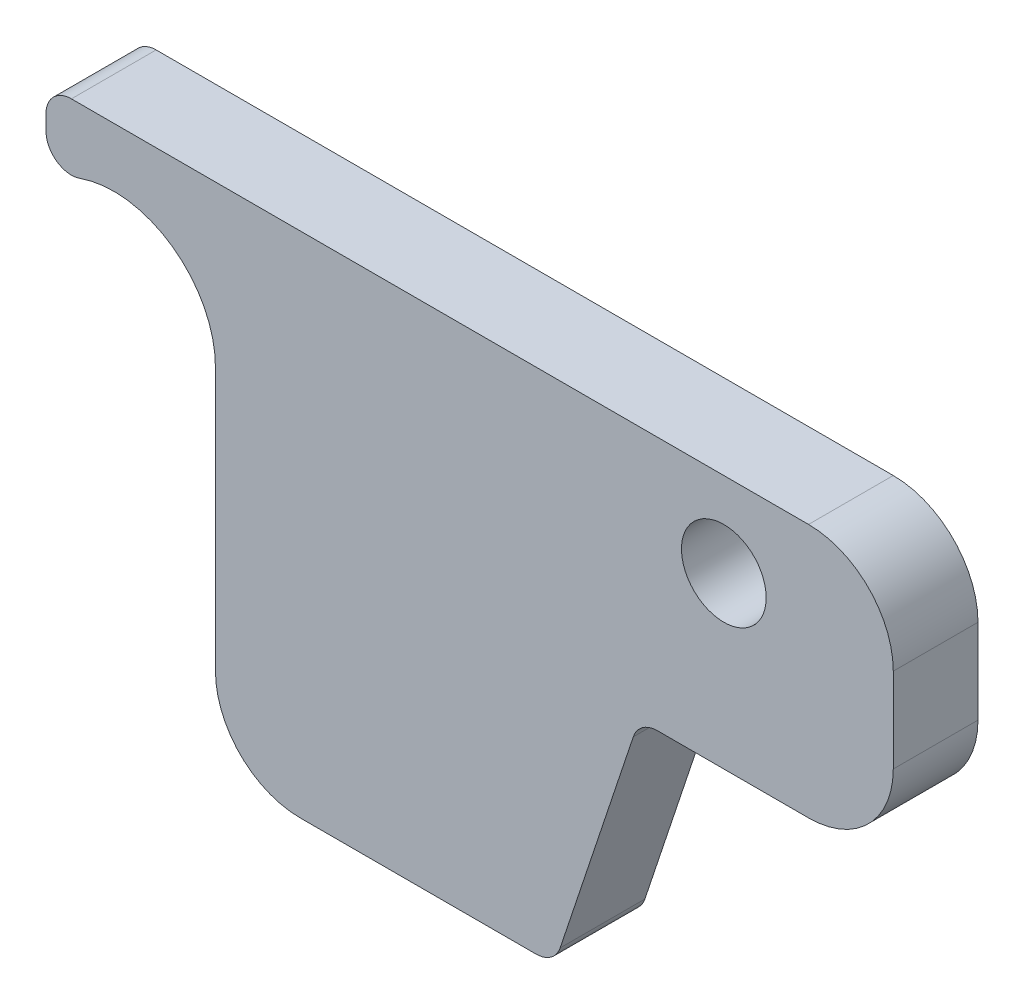
ISO-10303-21;
HEADER;
FILE_DESCRIPTION(('STEP AP214'),'2;1');
FILE_NAME('part.step','',(''),(''),'','','');
FILE_SCHEMA(('AUTOMOTIVE_DESIGN { 1 0 10303 214 1 1 1 1 }'));
ENDSEC;
DATA;
#1=APPLICATION_CONTEXT('core data for automotive mechanical design processes');
#2=APPLICATION_PROTOCOL_DEFINITION('international standard','automotive_design',2000,#1);
#3=PRODUCT_CONTEXT('',#1,'mechanical');
#4=PRODUCT('Part','Part','',(#3));
#5=PRODUCT_RELATED_PRODUCT_CATEGORY('part','',(#4));
#6=PRODUCT_DEFINITION_FORMATION('','',#4);
#7=PRODUCT_DEFINITION_CONTEXT('part definition',#1,'design');
#8=PRODUCT_DEFINITION('design','',#6,#7);
#9=PRODUCT_DEFINITION_SHAPE('','',#8);
#10=(LENGTH_UNIT() NAMED_UNIT(*) SI_UNIT(.MILLI.,.METRE.));
#11=(NAMED_UNIT(*) PLANE_ANGLE_UNIT() SI_UNIT($,.RADIAN.));
#12=(NAMED_UNIT(*) SI_UNIT($,.STERADIAN.) SOLID_ANGLE_UNIT());
#13=UNCERTAINTY_MEASURE_WITH_UNIT(LENGTH_MEASURE(1.E-05),#10,'distance_accuracy_value','');
#14=(GEOMETRIC_REPRESENTATION_CONTEXT(3) GLOBAL_UNCERTAINTY_ASSIGNED_CONTEXT((#13)) GLOBAL_UNIT_ASSIGNED_CONTEXT((#10,
#11,#12)) REPRESENTATION_CONTEXT('',''));
#15=CARTESIAN_POINT('',(0.,0.,0.));
#16=DIRECTION('',(0.,0.,1.));
#17=DIRECTION('',(1.,0.,0.));
#18=AXIS2_PLACEMENT_3D('',#15,#16,#17);
#19=CARTESIAN_POINT('',(50.0000000000022,30.0000000000006,10.0000000000017));
#20=DIRECTION('',(-1.00000000000003,0.,0.));
#21=DIRECTION('',(0.,-1.00000000000001,0.));
#22=AXIS2_PLACEMENT_3D('',#19,#20,#21);
#23=PLANE('',#22);
#24=DIRECTION('',(0.,1.00000000000001,0.));
#25=VECTOR('',#24,1.);
#26=CARTESIAN_POINT('',(50.0000000000008,30.,0.));
#27=LINE('',#26,#25);
#28=CARTESIAN_POINT('',(50.0000000000003,10.0000000000009,8.32667268468867E-13));
#29=VERTEX_POINT('',#28);
#30=CARTESIAN_POINT('',(49.9999999999994,20.0000000000015,9.99200722162641E-13));
#31=VERTEX_POINT('',#30);
#32=EDGE_CURVE('E183',#29,#31,#27,.T.);
#33=ORIENTED_EDGE('',*,*,#32,.T.);
#34=DIRECTION('',(0.,0.,-1.));
#35=VECTOR('',#34,1.);
#36=CARTESIAN_POINT('',(49.9999999999985,20.0000000000017,10.0000000000009));
#37=LINE('',#36,#35);
#38=CARTESIAN_POINT('',(49.9999999999985,20.0000000000017,10.0000000000009));
#39=VERTEX_POINT('',#38);
#40=EDGE_CURVE('E286',#31,#39,#37,.F.);
#41=ORIENTED_EDGE('',*,*,#40,.T.);
#42=DIRECTION('',(0.,1.00000000000001,0.));
#43=VECTOR('',#42,1.);
#44=CARTESIAN_POINT('',(50.0000000000022,30.0000000000006,10.0000000000017));
#45=LINE('',#44,#43);
#46=CARTESIAN_POINT('',(50.0000000000007,9.99999999999978,10.0000000000002));
#47=VERTEX_POINT('',#46);
#48=EDGE_CURVE('E189',#47,#39,#45,.T.);
#49=ORIENTED_EDGE('',*,*,#48,.F.);
#50=DIRECTION('',(0.,0.,1.));
#51=VECTOR('',#50,1.);
#52=CARTESIAN_POINT('',(50.0000000000007,9.99999999999978,10.0000000000002));
#53=LINE('',#52,#51);
#54=EDGE_CURVE('E283',#47,#29,#53,.F.);
#55=ORIENTED_EDGE('',*,*,#54,.T.);
#56=EDGE_LOOP('',(#33,#41,#49,#55));
#57=FACE_BOUND('',#56,.T.);
#58=ADVANCED_FACE('F38',(#57),#23,.F.);
#59=CARTESIAN_POINT('',(-50.0000000000025,29.9999999999994,10.0000000000003));
#60=DIRECTION('',(0.,-1.00000000000001,0.));
#61=DIRECTION('',(0.,0.,-1.));
#62=AXIS2_PLACEMENT_3D('',#59,#60,#61);
#63=PLANE('',#62);
#64=DIRECTION('',(-1.00000000000003,0.,0.));
#65=VECTOR('',#64,1.);
#66=CARTESIAN_POINT('',(-50.0000000000025,29.9999999999994,10.0000000000003));
#67=LINE('',#66,#65);
#68=CARTESIAN_POINT('',(40.0000000000025,30.0000000000009,10.0000000000011));
#69=VERTEX_POINT('',#68);
#70=CARTESIAN_POINT('',(-47.0000000000015,29.9999999999996,9.9999999999999));
#71=VERTEX_POINT('',#70);
#72=EDGE_CURVE('E192',#69,#71,#67,.T.);
#73=ORIENTED_EDGE('',*,*,#72,.F.);
#74=DIRECTION('',(0.,0.,-1.));
#75=VECTOR('',#74,1.);
#76=CARTESIAN_POINT('',(40.0000000000025,30.0000000000009,10.0000000000011));
#77=LINE('',#76,#75);
#78=CARTESIAN_POINT('',(40.0000000000008,30.0000000000009,1.84574577843932E-12));
#79=VERTEX_POINT('',#78);
#80=EDGE_CURVE('E270',#69,#79,#77,.T.);
#81=ORIENTED_EDGE('',*,*,#80,.T.);
#82=DIRECTION('',(-1.00000000000003,0.,0.));
#83=VECTOR('',#82,1.);
#84=CARTESIAN_POINT('',(-50.0000000000006,30.0000000000005,1.01307850997046E-12));
#85=LINE('',#84,#83);
#86=CARTESIAN_POINT('',(-46.9999999999999,29.9999999999995,0.));
#87=VERTEX_POINT('',#86);
#88=EDGE_CURVE('E206',#79,#87,#85,.T.);
#89=ORIENTED_EDGE('',*,*,#88,.T.);
#90=DIRECTION('',(0.,0.,-1.));
#91=VECTOR('',#90,1.);
#92=CARTESIAN_POINT('',(-47.0000000000015,29.9999999999996,9.9999999999999));
#93=LINE('',#92,#91);
#94=EDGE_CURVE('E256',#87,#71,#93,.F.);
#95=ORIENTED_EDGE('',*,*,#94,.T.);
#96=EDGE_LOOP('',(#73,#81,#89,#95));
#97=FACE_BOUND('',#96,.T.);
#98=ADVANCED_FACE('F340',(#97),#63,.F.);
#99=CARTESIAN_POINT('',(-50.0000000000025,29.9999999999994,10.0000000000003));
#100=DIRECTION('',(1.00000000000003,0.,0.));
#101=DIRECTION('',(0.,1.00000000000001,0.));
#102=AXIS2_PLACEMENT_3D('',#99,#100,#101);
#103=PLANE('',#102);
#104=DIRECTION('',(0.,-1.00000000000001,0.));
#105=VECTOR('',#104,1.);
#106=CARTESIAN_POINT('',(-50.0000000000025,29.9999999999994,10.0000000000003));
#107=LINE('',#106,#105);
#108=CARTESIAN_POINT('',(-50.0000000000038,26.9999999999987,10.0000000000007));
#109=VERTEX_POINT('',#108);
#110=CARTESIAN_POINT('',(-50.0000000000013,25.1978637137314,10.0000000000006));
#111=VERTEX_POINT('',#110);
#112=EDGE_CURVE('E196',#109,#111,#107,.T.);
#113=ORIENTED_EDGE('',*,*,#112,.F.);
#114=DIRECTION('',(0.,0.,-1.));
#115=VECTOR('',#114,1.);
#116=CARTESIAN_POINT('',(-50.0000000000038,26.9999999999987,10.0000000000007));
#117=LINE('',#116,#115);
#118=CARTESIAN_POINT('',(-50.0000000000032,27.000000000001,-4.02455846426619E-13));
#119=VERTEX_POINT('',#118);
#120=EDGE_CURVE('E252',#109,#119,#117,.T.);
#121=ORIENTED_EDGE('',*,*,#120,.T.);
#122=DIRECTION('',(0.,-1.00000000000001,0.));
#123=VECTOR('',#122,1.);
#124=CARTESIAN_POINT('',(-50.0000000000006,30.0000000000005,1.01307850997046E-12));
#125=LINE('',#124,#123);
#126=CARTESIAN_POINT('',(-49.9999999999971,25.197863713732,1.87350135405495E-12));
#127=VERTEX_POINT('',#126);
#128=EDGE_CURVE('E209',#119,#127,#125,.T.);
#129=ORIENTED_EDGE('',*,*,#128,.T.);
#130=DIRECTION('',(0.,0.,1.));
#131=VECTOR('',#130,1.);
#132=CARTESIAN_POINT('',(-50.0000000000013,25.1978637137314,10.0000000000006));
#133=LINE('',#132,#131);
#134=EDGE_CURVE('E248',#127,#111,#133,.T.);
#135=ORIENTED_EDGE('',*,*,#134,.T.);
#136=EDGE_LOOP('',(#113,#121,#129,#135));
#137=FACE_BOUND('',#136,.T.);
#138=ADVANCED_FACE('F331',(#137),#103,.F.);
#139=CARTESIAN_POINT('',(-50.000000000001,-30.0000000000009,9.99999999999966));
#140=DIRECTION('',(0.,1.00000000000001,0.));
#141=DIRECTION('',(0.,0.,1.));
#142=AXIS2_PLACEMENT_3D('',#139,#140,#141);
#143=PLANE('',#142);
#144=DIRECTION('',(1.00000000000003,0.,0.));
#145=VECTOR('',#144,1.);
#146=CARTESIAN_POINT('',(-50.000000000001,-30.0000000000009,9.99999999999966));
#147=LINE('',#146,#145);
#148=CARTESIAN_POINT('',(-20.0000000000007,-30.0000000000002,10.0000000000003));
#149=VERTEX_POINT('',#148);
#150=CARTESIAN_POINT('',(7.83772233983152,-30.0000000000001,10.0000000000014));
#151=VERTEX_POINT('',#150);
#152=EDGE_CURVE('E199',#149,#151,#147,.T.);
#153=ORIENTED_EDGE('',*,*,#152,.F.);
#154=DIRECTION('',(0.,0.,1.));
#155=VECTOR('',#154,1.);
#156=CARTESIAN_POINT('',(-20.0000000000007,-30.0000000000002,10.0000000000003));
#157=LINE('',#156,#155);
#158=CARTESIAN_POINT('',(-19.9999999999994,-30.0000000000006,8.46545056276682E-13));
#159=VERTEX_POINT('',#158);
#160=EDGE_CURVE('E11',#149,#159,#157,.F.);
#161=ORIENTED_EDGE('',*,*,#160,.T.);
#162=DIRECTION('',(1.00000000000003,0.,0.));
#163=VECTOR('',#162,1.);
#164=CARTESIAN_POINT('',(-50.0000000000002,-30.0000000000001,1.11022302462516E-13));
#165=LINE('',#164,#163);
#166=CARTESIAN_POINT('',(7.8377223398324,-29.9999999999999,1.346145417358E-12));
#167=VERTEX_POINT('',#166);
#168=EDGE_CURVE('E193',#159,#167,#165,.T.);
#169=ORIENTED_EDGE('',*,*,#168,.T.);
#170=DIRECTION('',(0.,0.,1.));
#171=VECTOR('',#170,1.);
#172=CARTESIAN_POINT('',(7.83772233983152,-30.0000000000001,10.0000000000014));
#173=LINE('',#172,#171);
#174=EDGE_CURVE('E225',#167,#151,#173,.T.);
#175=ORIENTED_EDGE('',*,*,#174,.T.);
#176=EDGE_LOOP('',(#153,#161,#169,#175));
#177=FACE_BOUND('',#176,.T.);
#178=ADVANCED_FACE('F384',(#177),#143,.F.);
#179=CARTESIAN_POINT('',(-1.38777878078145E-13,9.22872889219661E-13,10.0000000000008));
#180=DIRECTION('',(0.,0.,1.));
#181=DIRECTION('',(1.00000000000003,0.,0.));
#182=AXIS2_PLACEMENT_3D('',#179,#180,#181);
#183=PLANE('',#182);
#184=ORIENTED_EDGE('',*,*,#48,.T.);
#185=CARTESIAN_POINT('',(39.9999999999985,20.0000000000001,10.0000000000008));
#186=DIRECTION('',(0.,0.,1.));
#187=DIRECTION('',(1.00000000000003,0.,0.));
#188=AXIS2_PLACEMENT_3D('',#185,#186,#187);
#189=CIRCLE('',#188,10.);
#190=EDGE_CURVE('E293',#39,#69,#189,.T.);
#191=ORIENTED_EDGE('',*,*,#190,.T.);
#192=ORIENTED_EDGE('',*,*,#72,.T.);
#193=CARTESIAN_POINT('',(-47.0000000000016,26.9999999999997,10.0000000000009));
#194=DIRECTION('',(0.,0.,1.));
#195=DIRECTION('',(1.00000000000003,0.,0.));
#196=AXIS2_PLACEMENT_3D('',#193,#194,#195);
#197=CIRCLE('',#196,3.);
#198=EDGE_CURVE('E231',#71,#109,#197,.T.);
#199=ORIENTED_EDGE('',*,*,#198,.T.);
#200=ORIENTED_EDGE('',*,*,#112,.T.);
#201=CARTESIAN_POINT('',(-47.0000000000008,25.1978637137329,10.0000000000012));
#202=DIRECTION('',(0.,0.,1.));
#203=DIRECTION('',(1.00000000000003,0.,0.));
#204=AXIS2_PLACEMENT_3D('',#201,#202,#203);
#205=CIRCLE('',#204,3.);
#206=CARTESIAN_POINT('',(-46.0000000000013,22.3694365889861,10.000000000001));
#207=VERTEX_POINT('',#206);
#208=EDGE_CURVE('E172',#111,#207,#205,.T.);
#209=ORIENTED_EDGE('',*,*,#208,.T.);
#210=CARTESIAN_POINT('',(-42.0000000000025,11.0557280899991,10.0000000000006));
#211=DIRECTION('',(0.,0.,1.));
#212=DIRECTION('',(1.00000000000003,0.,0.));
#213=AXIS2_PLACEMENT_3D('',#210,#211,#212);
#214=CIRCLE('',#213,12.);
#215=CARTESIAN_POINT('',(-29.9999999999996,11.0557280900008,10.0000000000014));
#216=VERTEX_POINT('',#215);
#217=EDGE_CURVE('E156',#216,#207,#214,.T.);
#218=ORIENTED_EDGE('',*,*,#217,.F.);
#219=DIRECTION('',(0.,1.00000000000001,0.));
#220=VECTOR('',#219,1.);
#221=CARTESIAN_POINT('',(-29.9999999999996,11.0557280900008,10.0000000000014));
#222=LINE('',#221,#220);
#223=CARTESIAN_POINT('',(-30.0000000000013,-20.0000000000007,10.0000000000005));
#224=VERTEX_POINT('',#223);
#225=EDGE_CURVE('E147',#224,#216,#222,.T.);
#226=ORIENTED_EDGE('',*,*,#225,.F.);
#227=CARTESIAN_POINT('',(-19.9999999999997,-20.0000000000009,9.99999999999902));
#228=DIRECTION('',(0.,0.,1.));
#229=DIRECTION('',(1.00000000000003,0.,0.));
#230=AXIS2_PLACEMENT_3D('',#227,#228,#229);
#231=CIRCLE('',#230,10.);
#232=EDGE_CURVE('E54',#224,#149,#231,.T.);
#233=ORIENTED_EDGE('',*,*,#232,.T.);
#234=ORIENTED_EDGE('',*,*,#152,.T.);
#235=CARTESIAN_POINT('',(7.8377223398321,-27.0000000000008,10.0000000000001));
#236=DIRECTION('',(0.,0.,1.));
#237=DIRECTION('',(1.00000000000003,0.,0.));
#238=AXIS2_PLACEMENT_3D('',#235,#236,#237);
#239=CIRCLE('',#238,3.);
#240=CARTESIAN_POINT('',(10.6837722339818,-27.9486832980503,10.0000000000002));
#241=VERTEX_POINT('',#240);
#242=EDGE_CURVE('E234',#151,#241,#239,.T.);
#243=ORIENTED_EDGE('',*,*,#242,.T.);
#244=DIRECTION('',(-0.316227766016851,-0.948683298050519,0.));
#245=VECTOR('',#244,1.);
#246=CARTESIAN_POINT('',(20.0000000000003,5.82867087928207E-13,10.000000000001));
#247=LINE('',#246,#245);
#248=CARTESIAN_POINT('',(19.3162277660149,-2.05131670194864,10.0000000000006));
#249=VERTEX_POINT('',#248);
#250=EDGE_CURVE('E309',#249,#241,#247,.T.);
#251=ORIENTED_EDGE('',*,*,#250,.F.);
#252=CARTESIAN_POINT('',(22.1622776601672,-3.00000000000023,10.0000000000005));
#253=DIRECTION('',(0.,0.,1.));
#254=DIRECTION('',(1.00000000000003,0.,0.));
#255=AXIS2_PLACEMENT_3D('',#252,#253,#254);
#256=CIRCLE('',#255,3.);
#257=CARTESIAN_POINT('',(22.1622776601686,1.58206781009085E-12,10.0000000000003));
#258=VERTEX_POINT('',#257);
#259=EDGE_CURVE('E263',#249,#258,#256,.F.);
#260=ORIENTED_EDGE('',*,*,#259,.T.);
#261=DIRECTION('',(-1.00000000000003,0.,0.));
#262=VECTOR('',#261,1.);
#263=CARTESIAN_POINT('',(50.0000000000017,1.13103970633688E-12,10.0000000000018));
#264=LINE('',#263,#262);
#265=CARTESIAN_POINT('',(40.0000000000004,1.09634523681734E-12,10.0000000000006));
#266=VERTEX_POINT('',#265);
#267=EDGE_CURVE('E165',#266,#258,#264,.T.);
#268=ORIENTED_EDGE('',*,*,#267,.F.);
#269=CARTESIAN_POINT('',(40.,10.0000000000012,10.0000000000009));
#270=DIRECTION('',(0.,0.,1.));
#271=DIRECTION('',(1.00000000000003,0.,0.));
#272=AXIS2_PLACEMENT_3D('',#269,#270,#271);
#273=CIRCLE('',#272,10.);
#274=EDGE_CURVE('E62',#266,#47,#273,.T.);
#275=ORIENTED_EDGE('',*,*,#274,.T.);
#276=EDGE_LOOP('',(#184,#191,#192,#199,#200,#209,#218,#226,#233,#234,#243,#251,#260,#268,#275));
#277=FACE_BOUND('',#276,.T.);
#278=CARTESIAN_POINT('',(29.9999999999977,20.0000000000011,10.0000000000002));
#279=DIRECTION('',(0.,0.,1.));
#280=DIRECTION('',(1.00000000000003,0.,0.));
#281=AXIS2_PLACEMENT_3D('',#278,#279,#280);
#282=CIRCLE('',#281,5.);
#283=CARTESIAN_POINT('',(34.9999999999979,20.0000000000012,10.0000000000002));
#284=VERTEX_POINT('',#283);
#285=EDGE_CURVE('E184',#284,#284,#282,.T.);
#286=ORIENTED_EDGE('',*,*,#285,.F.);
#287=EDGE_LOOP('',(#286));
#288=FACE_BOUND('',#287,.T.);
#289=ADVANCED_FACE('F169',(#277,#288),#183,.T.);
#290=CARTESIAN_POINT('',(0.,0.,0.));
#291=DIRECTION('',(0.,0.,1.));
#292=DIRECTION('',(1.00000000000003,0.,0.));
#293=AXIS2_PLACEMENT_3D('',#290,#291,#292);
#294=PLANE('',#293);
#295=CARTESIAN_POINT('',(29.9999999999984,20.0000000000004,1.38777878078145E-13));
#296=DIRECTION('',(0.,0.,1.));
#297=DIRECTION('',(1.00000000000003,0.,0.));
#298=AXIS2_PLACEMENT_3D('',#295,#296,#297);
#299=CIRCLE('',#298,5.);
#300=CARTESIAN_POINT('',(34.9999999999986,20.0000000000004,1.31338602299795E-13));
#301=VERTEX_POINT('',#300);
#302=EDGE_CURVE('E180',#301,#301,#299,.T.);
#303=ORIENTED_EDGE('',*,*,#302,.T.);
#304=EDGE_LOOP('',(#303));
#305=FACE_BOUND('',#304,.T.);
#306=ORIENTED_EDGE('',*,*,#88,.F.);
#307=CARTESIAN_POINT('',(39.9999999999995,19.9999999999998,1.52655665885959E-13));
#308=DIRECTION('',(0.,0.,1.));
#309=DIRECTION('',(1.00000000000003,0.,0.));
#310=AXIS2_PLACEMENT_3D('',#307,#308,#309);
#311=CIRCLE('',#310,10.);
#312=EDGE_CURVE('E280',#79,#31,#311,.F.);
#313=ORIENTED_EDGE('',*,*,#312,.T.);
#314=ORIENTED_EDGE('',*,*,#32,.F.);
#315=CARTESIAN_POINT('',(40.,10.0000000000006,5.27355936696949E-13));
#316=DIRECTION('',(0.,0.,1.));
#317=DIRECTION('',(1.00000000000003,0.,0.));
#318=AXIS2_PLACEMENT_3D('',#315,#316,#317);
#319=CIRCLE('',#318,10.);
#320=CARTESIAN_POINT('',(40.0000000000013,4.44089209850063E-13,-1.11022302462516E-13));
#321=VERTEX_POINT('',#320);
#322=EDGE_CURVE('E277',#29,#321,#319,.F.);
#323=ORIENTED_EDGE('',*,*,#322,.T.);
#324=DIRECTION('',(-1.00000000000003,0.,0.));
#325=VECTOR('',#324,1.);
#326=CARTESIAN_POINT('',(50.0000000000013,1.47798440153224E-12,1.11022302462516E-12));
#327=LINE('',#326,#325);
#328=CARTESIAN_POINT('',(22.1622776601688,1.16573417585641E-12,1.76247905159244E-12));
#329=VERTEX_POINT('',#328);
#330=EDGE_CURVE('E305',#321,#329,#327,.T.);
#331=ORIENTED_EDGE('',*,*,#330,.T.);
#332=CARTESIAN_POINT('',(22.1622776601679,-2.99999999999873,0.));
#333=DIRECTION('',(0.,0.,1.));
#334=DIRECTION('',(1.00000000000003,0.,0.));
#335=AXIS2_PLACEMENT_3D('',#332,#333,#334);
#336=CIRCLE('',#335,3.);
#337=CARTESIAN_POINT('',(19.3162277660165,-2.05131670194901,7.7715611723761E-13));
#338=VERTEX_POINT('',#337);
#339=EDGE_CURVE('E267',#329,#338,#336,.T.);
#340=ORIENTED_EDGE('',*,*,#339,.T.);
#341=DIRECTION('',(-0.316227766016851,-0.948683298050519,0.));
#342=VECTOR('',#341,1.);
#343=CARTESIAN_POINT('',(20.0000000000003,-9.78384040450919E-13,1.66533453693773E-12));
#344=LINE('',#343,#342);
#345=CARTESIAN_POINT('',(10.6837722339815,-27.9486832980526,1.49880108324396E-12));
#346=VERTEX_POINT('',#345);
#347=EDGE_CURVE('E188',#338,#346,#344,.T.);
#348=ORIENTED_EDGE('',*,*,#347,.T.);
#349=CARTESIAN_POINT('',(7.83772233983177,-26.9999999999999,1.11022302462516E-12));
#350=DIRECTION('',(0.,0.,1.));
#351=DIRECTION('',(1.00000000000003,0.,0.));
#352=AXIS2_PLACEMENT_3D('',#349,#350,#351);
#353=CIRCLE('',#352,3.);
#354=EDGE_CURVE('E244',#346,#167,#353,.F.);
#355=ORIENTED_EDGE('',*,*,#354,.T.);
#356=ORIENTED_EDGE('',*,*,#168,.F.);
#357=CARTESIAN_POINT('',(-20.0000000000002,-19.9999999999996,1.73472347597681E-12));
#358=DIRECTION('',(0.,0.,1.));
#359=DIRECTION('',(1.00000000000003,0.,0.));
#360=AXIS2_PLACEMENT_3D('',#357,#358,#359);
#361=CIRCLE('',#360,10.);
#362=CARTESIAN_POINT('',(-29.9999999999997,-20.0000000000013,-2.91433543964104E-13));
#363=VERTEX_POINT('',#362);
#364=EDGE_CURVE('E274',#159,#363,#361,.F.);
#365=ORIENTED_EDGE('',*,*,#364,.T.);
#366=DIRECTION('',(0.,1.00000000000001,0.));
#367=VECTOR('',#366,1.);
#368=CARTESIAN_POINT('',(-30.0000000000007,11.0557280899984,5.27355936696949E-13));
#369=LINE('',#368,#367);
#370=CARTESIAN_POINT('',(-30.0000000000007,11.0557280899984,5.27355936696949E-13));
#371=VERTEX_POINT('',#370);
#372=EDGE_CURVE('E166',#363,#371,#369,.T.);
#373=ORIENTED_EDGE('',*,*,#372,.T.);
#374=CARTESIAN_POINT('',(-42.0000000000018,11.0557280900021,5.41233724504764E-13));
#375=DIRECTION('',(0.,0.,1.));
#376=DIRECTION('',(1.00000000000003,0.,0.));
#377=AXIS2_PLACEMENT_3D('',#374,#375,#376);
#378=CIRCLE('',#377,12.);
#379=CARTESIAN_POINT('',(-46.0000000000015,22.3694365889872,-5.68989300120393E-13));
#380=VERTEX_POINT('',#379);
#381=EDGE_CURVE('E155',#371,#380,#378,.T.);
#382=ORIENTED_EDGE('',*,*,#381,.T.);
#383=CARTESIAN_POINT('',(-46.9999999999997,25.1978637137311,1.12410081243297E-12));
#384=DIRECTION('',(0.,0.,1.));
#385=DIRECTION('',(1.00000000000003,0.,0.));
#386=AXIS2_PLACEMENT_3D('',#383,#384,#385);
#387=CIRCLE('',#386,3.);
#388=EDGE_CURVE('E237',#380,#127,#387,.F.);
#389=ORIENTED_EDGE('',*,*,#388,.T.);
#390=ORIENTED_EDGE('',*,*,#128,.F.);
#391=CARTESIAN_POINT('',(-47.0000000000018,27.0000000000004,4.9960036108132E-13));
#392=DIRECTION('',(0.,0.,1.));
#393=DIRECTION('',(1.00000000000003,0.,0.));
#394=AXIS2_PLACEMENT_3D('',#391,#392,#393);
#395=CIRCLE('',#394,3.);
#396=EDGE_CURVE('E240',#119,#87,#395,.F.);
#397=ORIENTED_EDGE('',*,*,#396,.T.);
#398=EDGE_LOOP('',(#306,#313,#314,#323,#331,#340,#348,#355,#356,#365,#373,#382,#389,#390,#397));
#399=FACE_BOUND('',#398,.T.);
#400=ADVANCED_FACE('F324',(#305,#399),#294,.F.);
#401=CARTESIAN_POINT('',(29.9999999999984,20.0000000000004,1.38777878078145E-13));
#402=DIRECTION('',(0.,0.,1.));
#403=DIRECTION('',(1.00000000000003,0.,0.));
#404=AXIS2_PLACEMENT_3D('',#401,#402,#403);
#405=CYLINDRICAL_SURFACE('',#404,5.);
#406=ORIENTED_EDGE('',*,*,#302,.F.);
#407=EDGE_LOOP('',(#406));
#408=FACE_BOUND('',#407,.T.);
#409=ORIENTED_EDGE('',*,*,#285,.T.);
#410=EDGE_LOOP('',(#409));
#411=FACE_BOUND('',#410,.T.);
#412=ADVANCED_FACE('F390',(#408,#411),#405,.F.);
#413=CARTESIAN_POINT('',(20.0000000000003,-9.78384040450919E-13,1.66533453693773E-12));
#414=DIRECTION('',(-0.948683298050537,0.316227766016839,0.));
#415=DIRECTION('',(-0.316227766016851,-0.948683298050521,0.));
#416=AXIS2_PLACEMENT_3D('',#413,#414,#415);
#417=PLANE('',#416);
#418=ORIENTED_EDGE('',*,*,#347,.F.);
#419=DIRECTION('',(0.,0.,1.));
#420=VECTOR('',#419,1.);
#421=CARTESIAN_POINT('',(19.3162277660149,-2.05131670194864,10.0000000000006));
#422=LINE('',#421,#420);
#423=EDGE_CURVE('E217',#338,#249,#422,.T.);
#424=ORIENTED_EDGE('',*,*,#423,.T.);
#425=ORIENTED_EDGE('',*,*,#250,.T.);
#426=DIRECTION('',(0.,0.,1.));
#427=VECTOR('',#426,1.);
#428=CARTESIAN_POINT('',(10.6837722339815,-27.9486832980526,1.49880108324396E-12));
#429=LINE('',#428,#427);
#430=EDGE_CURVE('E202',#241,#346,#429,.F.);
#431=ORIENTED_EDGE('',*,*,#430,.T.);
#432=EDGE_LOOP('',(#418,#424,#425,#431));
#433=FACE_BOUND('',#432,.T.);
#434=ADVANCED_FACE('F362',(#433),#417,.F.);
#435=CARTESIAN_POINT('',(50.0000000000013,1.47798440153224E-12,1.11022302462516E-12));
#436=DIRECTION('',(0.,1.00000000000001,0.));
#437=DIRECTION('',(-1.00000000000003,0.,0.));
#438=AXIS2_PLACEMENT_3D('',#435,#436,#437);
#439=PLANE('',#438);
#440=ORIENTED_EDGE('',*,*,#330,.F.);
#441=DIRECTION('',(0.,0.,1.));
#442=VECTOR('',#441,1.);
#443=CARTESIAN_POINT('',(40.0000000000013,4.44089209850063E-13,-1.11022302462516E-13));
#444=LINE('',#443,#442);
#445=EDGE_CURVE('E296',#321,#266,#444,.T.);
#446=ORIENTED_EDGE('',*,*,#445,.T.);
#447=ORIENTED_EDGE('',*,*,#267,.T.);
#448=DIRECTION('',(0.,0.,1.));
#449=VECTOR('',#448,1.);
#450=CARTESIAN_POINT('',(22.1622776601688,1.16573417585641E-12,1.76247905159244E-12));
#451=LINE('',#450,#449);
#452=EDGE_CURVE('E221',#258,#329,#451,.F.);
#453=ORIENTED_EDGE('',*,*,#452,.T.);
#454=EDGE_LOOP('',(#440,#446,#447,#453));
#455=FACE_BOUND('',#454,.T.);
#456=ADVANCED_FACE('F353',(#455),#439,.F.);
#457=CARTESIAN_POINT('',(-42.0000000000018,11.0557280900021,5.41233724504764E-13));
#458=DIRECTION('',(0.,0.,1.));
#459=DIRECTION('',(1.00000000000003,0.,0.));
#460=AXIS2_PLACEMENT_3D('',#457,#458,#459);
#461=CYLINDRICAL_SURFACE('',#460,12.);
#462=ORIENTED_EDGE('',*,*,#217,.T.);
#463=DIRECTION('',(0.,0.,1.));
#464=VECTOR('',#463,1.);
#465=CARTESIAN_POINT('',(-46.0000000000015,22.3694365889872,-5.68989300120393E-13));
#466=LINE('',#465,#464);
#467=EDGE_CURVE('E260',#207,#380,#466,.F.);
#468=ORIENTED_EDGE('',*,*,#467,.T.);
#469=ORIENTED_EDGE('',*,*,#381,.F.);
#470=DIRECTION('',(0.,0.,1.));
#471=VECTOR('',#470,1.);
#472=CARTESIAN_POINT('',(-30.0000000000007,11.0557280899984,5.27355936696949E-13));
#473=LINE('',#472,#471);
#474=EDGE_CURVE('E151',#371,#216,#473,.T.);
#475=ORIENTED_EDGE('',*,*,#474,.T.);
#476=EDGE_LOOP('',(#462,#468,#469,#475));
#477=FACE_BOUND('',#476,.T.);
#478=ADVANCED_FACE('F161',(#477),#461,.F.);
#479=CARTESIAN_POINT('',(-30.0000000000007,11.0557280899984,5.27355936696949E-13));
#480=DIRECTION('',(1.00000000000003,0.,0.));
#481=DIRECTION('',(0.,1.00000000000001,0.));
#482=AXIS2_PLACEMENT_3D('',#479,#480,#481);
#483=PLANE('',#482);
#484=ORIENTED_EDGE('',*,*,#372,.F.);
#485=DIRECTION('',(0.,0.,1.));
#486=VECTOR('',#485,1.);
#487=CARTESIAN_POINT('',(-29.9999999999997,-20.0000000000013,-2.91433543964104E-13));
#488=LINE('',#487,#486);
#489=EDGE_CURVE('E47',#363,#224,#488,.T.);
#490=ORIENTED_EDGE('',*,*,#489,.T.);
#491=ORIENTED_EDGE('',*,*,#225,.T.);
#492=ORIENTED_EDGE('',*,*,#474,.F.);
#493=EDGE_LOOP('',(#484,#490,#491,#492));
#494=FACE_BOUND('',#493,.T.);
#495=ADVANCED_FACE('F150',(#494),#483,.F.);
#496=CARTESIAN_POINT('',(22.1622776601679,-2.99999999999873,0.));
#497=DIRECTION('',(0.,0.,-1.));
#498=DIRECTION('',(-1.00000000000003,0.,0.));
#499=AXIS2_PLACEMENT_3D('',#496,#497,#498);
#500=CYLINDRICAL_SURFACE('',#499,3.);
#501=ORIENTED_EDGE('',*,*,#339,.F.);
#502=ORIENTED_EDGE('',*,*,#452,.F.);
#503=ORIENTED_EDGE('',*,*,#259,.F.);
#504=ORIENTED_EDGE('',*,*,#423,.F.);
#505=EDGE_LOOP('',(#501,#502,#503,#504));
#506=FACE_BOUND('',#505,.T.);
#507=ADVANCED_FACE('F364',(#506),#500,.F.);
#508=CARTESIAN_POINT('',(7.8377223398321,-27.0000000000008,10.0000000000001));
#509=DIRECTION('',(0.,0.,1.));
#510=DIRECTION('',(1.00000000000003,0.,0.));
#511=AXIS2_PLACEMENT_3D('',#508,#509,#510);
#512=CYLINDRICAL_SURFACE('',#511,3.);
#513=ORIENTED_EDGE('',*,*,#354,.F.);
#514=ORIENTED_EDGE('',*,*,#430,.F.);
#515=ORIENTED_EDGE('',*,*,#242,.F.);
#516=ORIENTED_EDGE('',*,*,#174,.F.);
#517=EDGE_LOOP('',(#513,#514,#515,#516));
#518=FACE_BOUND('',#517,.T.);
#519=ADVANCED_FACE('F366',(#518),#512,.T.);
#520=CARTESIAN_POINT('',(-47.0000000000016,26.9999999999997,10.0000000000009));
#521=DIRECTION('',(0.,0.,-1.));
#522=DIRECTION('',(-1.00000000000003,0.,0.));
#523=AXIS2_PLACEMENT_3D('',#520,#521,#522);
#524=CYLINDRICAL_SURFACE('',#523,3.);
#525=ORIENTED_EDGE('',*,*,#198,.F.);
#526=ORIENTED_EDGE('',*,*,#94,.F.);
#527=ORIENTED_EDGE('',*,*,#396,.F.);
#528=ORIENTED_EDGE('',*,*,#120,.F.);
#529=EDGE_LOOP('',(#525,#526,#527,#528));
#530=FACE_BOUND('',#529,.T.);
#531=ADVANCED_FACE('F337',(#530),#524,.T.);
#532=CARTESIAN_POINT('',(-46.9999999999997,25.1978637137311,1.12410081243297E-12));
#533=DIRECTION('',(0.,0.,1.));
#534=DIRECTION('',(1.00000000000003,0.,0.));
#535=AXIS2_PLACEMENT_3D('',#532,#533,#534);
#536=CYLINDRICAL_SURFACE('',#535,3.);
#537=ORIENTED_EDGE('',*,*,#388,.F.);
#538=ORIENTED_EDGE('',*,*,#467,.F.);
#539=ORIENTED_EDGE('',*,*,#208,.F.);
#540=ORIENTED_EDGE('',*,*,#134,.F.);
#541=EDGE_LOOP('',(#537,#538,#539,#540));
#542=FACE_BOUND('',#541,.T.);
#543=ADVANCED_FACE('F328',(#542),#536,.T.);
#544=CARTESIAN_POINT('',(39.9999999999985,20.0000000000001,10.0000000000008));
#545=DIRECTION('',(0.,0.,-1.));
#546=DIRECTION('',(-1.00000000000003,0.,0.));
#547=AXIS2_PLACEMENT_3D('',#544,#545,#546);
#548=CYLINDRICAL_SURFACE('',#547,10.);
#549=ORIENTED_EDGE('',*,*,#190,.F.);
#550=ORIENTED_EDGE('',*,*,#40,.F.);
#551=ORIENTED_EDGE('',*,*,#312,.F.);
#552=ORIENTED_EDGE('',*,*,#80,.F.);
#553=EDGE_LOOP('',(#549,#550,#551,#552));
#554=FACE_BOUND('',#553,.T.);
#555=ADVANCED_FACE('F344',(#554),#548,.T.);
#556=CARTESIAN_POINT('',(40.,10.0000000000006,5.27355936696949E-13));
#557=DIRECTION('',(0.,0.,1.));
#558=DIRECTION('',(1.00000000000003,0.,0.));
#559=AXIS2_PLACEMENT_3D('',#556,#557,#558);
#560=CYLINDRICAL_SURFACE('',#559,10.);
#561=ORIENTED_EDGE('',*,*,#322,.F.);
#562=ORIENTED_EDGE('',*,*,#54,.F.);
#563=ORIENTED_EDGE('',*,*,#274,.F.);
#564=ORIENTED_EDGE('',*,*,#445,.F.);
#565=EDGE_LOOP('',(#561,#562,#563,#564));
#566=FACE_BOUND('',#565,.T.);
#567=ADVANCED_FACE('F356',(#566),#560,.T.);
#568=CARTESIAN_POINT('',(-20.0000000000002,-19.9999999999996,1.73472347597681E-12));
#569=DIRECTION('',(0.,0.,1.));
#570=DIRECTION('',(1.00000000000003,0.,0.));
#571=AXIS2_PLACEMENT_3D('',#568,#569,#570);
#572=CYLINDRICAL_SURFACE('',#571,10.);
#573=ORIENTED_EDGE('',*,*,#364,.F.);
#574=ORIENTED_EDGE('',*,*,#160,.F.);
#575=ORIENTED_EDGE('',*,*,#232,.F.);
#576=ORIENTED_EDGE('',*,*,#489,.F.);
#577=EDGE_LOOP('',(#573,#574,#575,#576));
#578=FACE_BOUND('',#577,.T.);
#579=ADVANCED_FACE('F40',(#578),#572,.T.);
#580=CLOSED_SHELL('',(#58,#98,#138,#178,#289,#400,#412,#434,#456,#478,#495,#507,#519,#531,#543,
#555,#567,#579));
#581=MANIFOLD_SOLID_BREP('B2',#580);
#582=ADVANCED_BREP_SHAPE_REPRESENTATION('',(#18,#581),#14);
#583=SHAPE_DEFINITION_REPRESENTATION(#9,#582);
ENDSEC;
END-ISO-10303-21;
